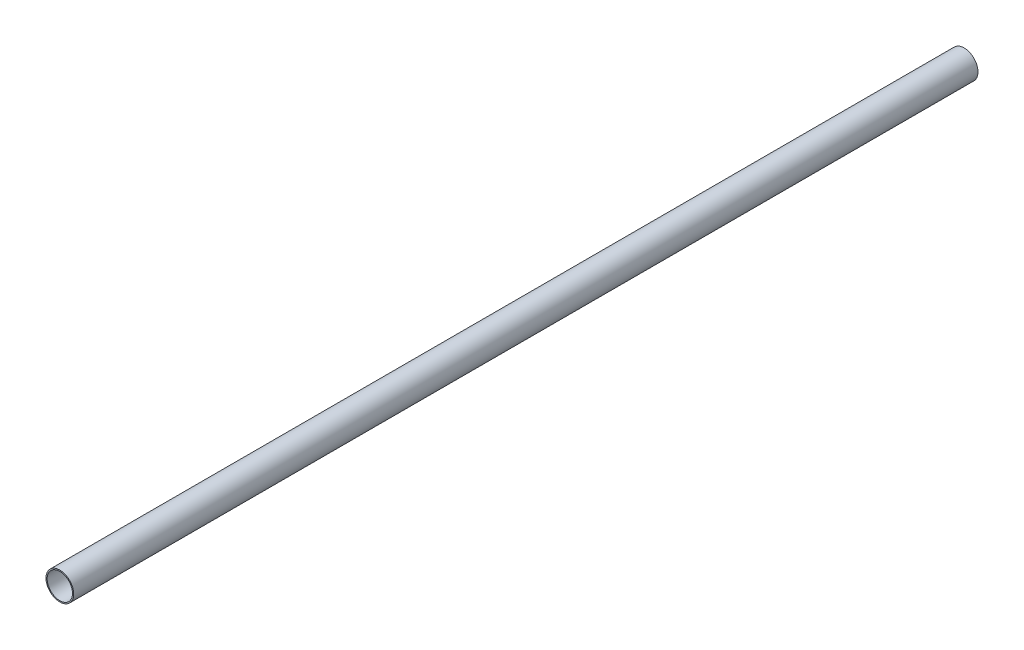
ISO-10303-21;
HEADER;
FILE_DESCRIPTION(('STEP AP214'),'2;1');
FILE_NAME('part.step','',(''),(''),'','','');
FILE_SCHEMA(('AUTOMOTIVE_DESIGN { 1 0 10303 214 1 1 1 1 }'));
ENDSEC;
DATA;
#1=APPLICATION_CONTEXT('core data for automotive mechanical design processes');
#2=APPLICATION_PROTOCOL_DEFINITION('international standard','automotive_design',2000,#1);
#3=PRODUCT_CONTEXT('',#1,'mechanical');
#4=PRODUCT('Part','Part','',(#3));
#5=PRODUCT_RELATED_PRODUCT_CATEGORY('part','',(#4));
#6=PRODUCT_DEFINITION_FORMATION('','',#4);
#7=PRODUCT_DEFINITION_CONTEXT('part definition',#1,'design');
#8=PRODUCT_DEFINITION('design','',#6,#7);
#9=PRODUCT_DEFINITION_SHAPE('','',#8);
#10=(LENGTH_UNIT() NAMED_UNIT(*) SI_UNIT(.MILLI.,.METRE.));
#11=(NAMED_UNIT(*) PLANE_ANGLE_UNIT() SI_UNIT($,.RADIAN.));
#12=(NAMED_UNIT(*) SI_UNIT($,.STERADIAN.) SOLID_ANGLE_UNIT());
#13=UNCERTAINTY_MEASURE_WITH_UNIT(LENGTH_MEASURE(1.E-05),#10,'distance_accuracy_value','');
#14=(GEOMETRIC_REPRESENTATION_CONTEXT(3) GLOBAL_UNCERTAINTY_ASSIGNED_CONTEXT((#13)) GLOBAL_UNIT_ASSIGNED_CONTEXT((#10,
#11,#12)) REPRESENTATION_CONTEXT('',''));
#15=CARTESIAN_POINT('',(0.,0.,0.));
#16=DIRECTION('',(0.,0.,1.));
#17=DIRECTION('',(1.,0.,0.));
#18=AXIS2_PLACEMENT_3D('',#15,#16,#17);
#19=CARTESIAN_POINT('',(0.,0.,5486.4));
#20=DIRECTION('',(0.,0.,1.));
#21=DIRECTION('',(1.,0.,0.));
#22=AXIS2_PLACEMENT_3D('',#19,#20,#21);
#23=PLANE('',#22);
#24=CARTESIAN_POINT('',(0.,0.,5486.4));
#25=DIRECTION('',(0.,0.,1.));
#26=DIRECTION('',(1.,0.,0.));
#27=AXIS2_PLACEMENT_3D('',#24,#25,#26);
#28=CIRCLE('',#27,84.074);
#29=CARTESIAN_POINT('',(84.074,0.,5486.4));
#30=VERTEX_POINT('',#29);
#31=EDGE_CURVE('E10',#30,#30,#28,.T.);
#32=ORIENTED_EDGE('',*,*,#31,.T.);
#33=EDGE_LOOP('',(#32));
#34=FACE_BOUND('',#33,.T.);
#35=CARTESIAN_POINT('',(0.,0.,5486.4));
#36=DIRECTION('',(0.,0.,1.));
#37=DIRECTION('',(1.,0.,0.));
#38=AXIS2_PLACEMENT_3D('',#35,#36,#37);
#39=CIRCLE('',#38,76.962);
#40=CARTESIAN_POINT('',(76.962,0.,5486.4));
#41=VERTEX_POINT('',#40);
#42=EDGE_CURVE('E39',#41,#41,#39,.T.);
#43=ORIENTED_EDGE('',*,*,#42,.F.);
#44=EDGE_LOOP('',(#43));
#45=FACE_BOUND('',#44,.T.);
#46=ADVANCED_FACE('F28',(#34,#45),#23,.T.);
#47=CARTESIAN_POINT('',(0.,0.,0.));
#48=DIRECTION('',(0.,0.,1.));
#49=DIRECTION('',(1.,0.,0.));
#50=AXIS2_PLACEMENT_3D('',#47,#48,#49);
#51=PLANE('',#50);
#52=CARTESIAN_POINT('',(0.,0.,0.));
#53=DIRECTION('',(0.,0.,1.));
#54=DIRECTION('',(1.,0.,0.));
#55=AXIS2_PLACEMENT_3D('',#52,#53,#54);
#56=CIRCLE('',#55,84.074);
#57=CARTESIAN_POINT('',(84.074,0.,0.));
#58=VERTEX_POINT('',#57);
#59=EDGE_CURVE('E32',#58,#58,#56,.T.);
#60=ORIENTED_EDGE('',*,*,#59,.F.);
#61=EDGE_LOOP('',(#60));
#62=FACE_BOUND('',#61,.T.);
#63=CARTESIAN_POINT('',(0.,0.,0.));
#64=DIRECTION('',(0.,0.,1.));
#65=DIRECTION('',(1.,0.,0.));
#66=AXIS2_PLACEMENT_3D('',#63,#64,#65);
#67=CIRCLE('',#66,76.962);
#68=CARTESIAN_POINT('',(76.962,0.,0.));
#69=VERTEX_POINT('',#68);
#70=EDGE_CURVE('E41',#69,#69,#67,.T.);
#71=ORIENTED_EDGE('',*,*,#70,.T.);
#72=EDGE_LOOP('',(#71));
#73=FACE_BOUND('',#72,.T.);
#74=ADVANCED_FACE('F51',(#62,#73),#51,.F.);
#75=CARTESIAN_POINT('',(0.,0.,5486.4));
#76=DIRECTION('',(0.,0.,-1.));
#77=DIRECTION('',(-1.,0.,0.));
#78=AXIS2_PLACEMENT_3D('',#75,#76,#77);
#79=CYLINDRICAL_SURFACE('',#78,84.074);
#80=ORIENTED_EDGE('',*,*,#31,.F.);
#81=EDGE_LOOP('',(#80));
#82=FACE_BOUND('',#81,.T.);
#83=ORIENTED_EDGE('',*,*,#59,.T.);
#84=EDGE_LOOP('',(#83));
#85=FACE_BOUND('',#84,.T.);
#86=ADVANCED_FACE('F30',(#82,#85),#79,.T.);
#87=CARTESIAN_POINT('',(0.,0.,5486.4));
#88=DIRECTION('',(0.,0.,-1.));
#89=DIRECTION('',(-1.,0.,0.));
#90=AXIS2_PLACEMENT_3D('',#87,#88,#89);
#91=CYLINDRICAL_SURFACE('',#90,76.962);
#92=ORIENTED_EDGE('',*,*,#42,.T.);
#93=EDGE_LOOP('',(#92));
#94=FACE_BOUND('',#93,.T.);
#95=ORIENTED_EDGE('',*,*,#70,.F.);
#96=EDGE_LOOP('',(#95));
#97=FACE_BOUND('',#96,.T.);
#98=ADVANCED_FACE('F47',(#94,#97),#91,.F.);
#99=CLOSED_SHELL('',(#46,#74,#86,#98));
#100=MANIFOLD_SOLID_BREP('B2',#99);
#101=ADVANCED_BREP_SHAPE_REPRESENTATION('',(#18,#100),#14);
#102=SHAPE_DEFINITION_REPRESENTATION(#9,#101);
ENDSEC;
END-ISO-10303-21;
